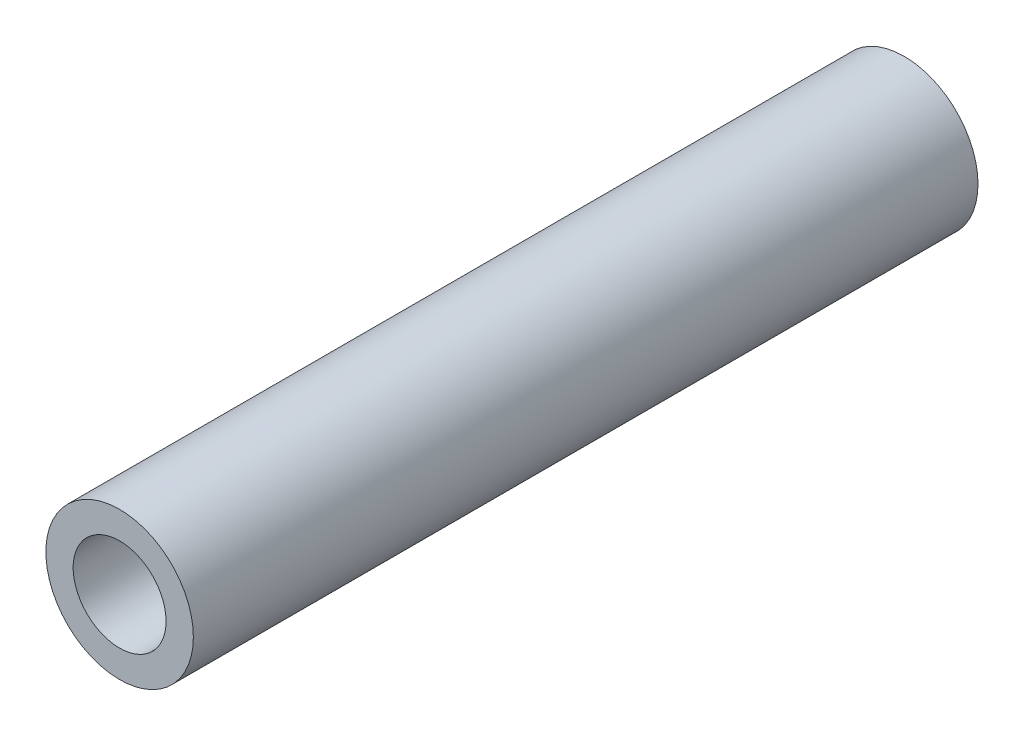
ISO-10303-21;
HEADER;
FILE_DESCRIPTION(('STEP AP214'),'2;1');
FILE_NAME('part.step','',(''),(''),'','','');
FILE_SCHEMA(('AUTOMOTIVE_DESIGN { 1 0 10303 214 1 1 1 1 }'));
ENDSEC;
DATA;
#1=APPLICATION_CONTEXT('core data for automotive mechanical design processes');
#2=APPLICATION_PROTOCOL_DEFINITION('international standard','automotive_design',2000,#1);
#3=PRODUCT_CONTEXT('',#1,'mechanical');
#4=PRODUCT('Part','Part','',(#3));
#5=PRODUCT_RELATED_PRODUCT_CATEGORY('part','',(#4));
#6=PRODUCT_DEFINITION_FORMATION('','',#4);
#7=PRODUCT_DEFINITION_CONTEXT('part definition',#1,'design');
#8=PRODUCT_DEFINITION('design','',#6,#7);
#9=PRODUCT_DEFINITION_SHAPE('','',#8);
#10=(LENGTH_UNIT() NAMED_UNIT(*) SI_UNIT(.MILLI.,.METRE.));
#11=(NAMED_UNIT(*) PLANE_ANGLE_UNIT() SI_UNIT($,.RADIAN.));
#12=(NAMED_UNIT(*) SI_UNIT($,.STERADIAN.) SOLID_ANGLE_UNIT());
#13=UNCERTAINTY_MEASURE_WITH_UNIT(LENGTH_MEASURE(1.E-05),#10,'distance_accuracy_value','');
#14=(GEOMETRIC_REPRESENTATION_CONTEXT(3) GLOBAL_UNCERTAINTY_ASSIGNED_CONTEXT((#13)) GLOBAL_UNIT_ASSIGNED_CONTEXT((#10,
#11,#12)) REPRESENTATION_CONTEXT('',''));
#15=CARTESIAN_POINT('',(0.,0.,0.));
#16=DIRECTION('',(0.,0.,1.));
#17=DIRECTION('',(1.,0.,0.));
#18=AXIS2_PLACEMENT_3D('',#15,#16,#17);
#19=CARTESIAN_POINT('',(0.,0.,-41.8717561210692));
#20=DIRECTION('',(0.,0.,1.));
#21=DIRECTION('',(1.,0.,0.));
#22=AXIS2_PLACEMENT_3D('',#19,#20,#21);
#23=CYLINDRICAL_SURFACE('',#22,2.286);
#24=CARTESIAN_POINT('',(0.,0.,-33.7805));
#25=DIRECTION('',(0.,0.,-1.));
#26=DIRECTION('',(-1.,0.,0.));
#27=AXIS2_PLACEMENT_3D('',#24,#25,#26);
#28=CIRCLE('',#27,2.286);
#29=CARTESIAN_POINT('',(-2.286,0.,-33.7805));
#30=VERTEX_POINT('',#29);
#31=EDGE_CURVE('E56',#30,#30,#28,.T.);
#32=ORIENTED_EDGE('',*,*,#31,.T.);
#33=EDGE_LOOP('',(#32));
#34=FACE_BOUND('',#33,.T.);
#35=CARTESIAN_POINT('',(0.,0.,-12.7));
#36=DIRECTION('',(0.,0.,1.));
#37=DIRECTION('',(1.,0.,0.));
#38=AXIS2_PLACEMENT_3D('',#35,#36,#37);
#39=CIRCLE('',#38,2.286);
#40=CARTESIAN_POINT('',(2.286,0.,-12.7));
#41=VERTEX_POINT('',#40);
#42=EDGE_CURVE('E11',#41,#41,#39,.F.);
#43=ORIENTED_EDGE('',*,*,#42,.F.);
#44=EDGE_LOOP('',(#43));
#45=FACE_BOUND('',#44,.T.);
#46=ADVANCED_FACE('F42',(#34,#45),#23,.F.);
#47=CARTESIAN_POINT('',(0.,0.,-41.8717561210692));
#48=DIRECTION('',(0.,0.,1.));
#49=DIRECTION('',(1.,0.,0.));
#50=AXIS2_PLACEMENT_3D('',#47,#48,#49);
#51=CYLINDRICAL_SURFACE('',#50,3.175);
#52=CARTESIAN_POINT('',(0.,0.,0.));
#53=DIRECTION('',(0.,0.,1.));
#54=DIRECTION('',(1.,0.,0.));
#55=AXIS2_PLACEMENT_3D('',#52,#53,#54);
#56=CIRCLE('',#55,3.175);
#57=CARTESIAN_POINT('',(3.175,0.,0.));
#58=VERTEX_POINT('',#57);
#59=EDGE_CURVE('E48',#58,#58,#56,.T.);
#60=ORIENTED_EDGE('',*,*,#59,.F.);
#61=EDGE_LOOP('',(#60));
#62=FACE_BOUND('',#61,.T.);
#63=CARTESIAN_POINT('',(0.,0.,-33.7805));
#64=DIRECTION('',(0.,0.,-1.));
#65=DIRECTION('',(-1.,0.,0.));
#66=AXIS2_PLACEMENT_3D('',#63,#64,#65);
#67=CIRCLE('',#66,3.175);
#68=CARTESIAN_POINT('',(-3.175,0.,-33.7805));
#69=VERTEX_POINT('',#68);
#70=EDGE_CURVE('E52',#69,#69,#67,.T.);
#71=ORIENTED_EDGE('',*,*,#70,.F.);
#72=EDGE_LOOP('',(#71));
#73=FACE_BOUND('',#72,.T.);
#74=ADVANCED_FACE('F73',(#62,#73),#51,.T.);
#75=CARTESIAN_POINT('',(0.,0.,0.));
#76=DIRECTION('',(0.,0.,1.));
#77=DIRECTION('',(1.,0.,0.));
#78=AXIS2_PLACEMENT_3D('',#75,#76,#77);
#79=PLANE('',#78);
#80=ORIENTED_EDGE('',*,*,#59,.T.);
#81=EDGE_LOOP('',(#80));
#82=FACE_BOUND('',#81,.T.);
#83=CARTESIAN_POINT('',(0.,0.,0.));
#84=DIRECTION('',(0.,0.,1.));
#85=DIRECTION('',(1.,0.,0.));
#86=AXIS2_PLACEMENT_3D('',#83,#84,#85);
#87=CIRCLE('',#86,2.);
#88=CARTESIAN_POINT('',(2.,0.,0.));
#89=VERTEX_POINT('',#88);
#90=EDGE_CURVE('E64',#89,#89,#87,.T.);
#91=ORIENTED_EDGE('',*,*,#90,.F.);
#92=EDGE_LOOP('',(#91));
#93=FACE_BOUND('',#92,.T.);
#94=ADVANCED_FACE('F70',(#82,#93),#79,.T.);
#95=CARTESIAN_POINT('',(0.,0.,-33.7805));
#96=DIRECTION('',(0.,0.,-1.));
#97=DIRECTION('',(-1.,0.,0.));
#98=AXIS2_PLACEMENT_3D('',#95,#96,#97);
#99=PLANE('',#98);
#100=ORIENTED_EDGE('',*,*,#70,.T.);
#101=EDGE_LOOP('',(#100));
#102=FACE_BOUND('',#101,.T.);
#103=ORIENTED_EDGE('',*,*,#31,.F.);
#104=EDGE_LOOP('',(#103));
#105=FACE_BOUND('',#104,.T.);
#106=ADVANCED_FACE('F72',(#102,#105),#99,.T.);
#107=CARTESIAN_POINT('',(0.,0.,-12.7));
#108=DIRECTION('',(0.,0.,1.));
#109=DIRECTION('',(1.,0.,0.));
#110=AXIS2_PLACEMENT_3D('',#107,#108,#109);
#111=PLANE('',#110);
#112=CARTESIAN_POINT('',(0.,0.,-12.7));
#113=DIRECTION('',(0.,0.,1.));
#114=DIRECTION('',(1.,0.,0.));
#115=AXIS2_PLACEMENT_3D('',#112,#113,#114);
#116=CIRCLE('',#115,1.77832067541164);
#117=CARTESIAN_POINT('',(1.77832067541164,0.,-12.7));
#118=VERTEX_POINT('',#117);
#119=EDGE_CURVE('E61',#118,#118,#116,.T.);
#120=ORIENTED_EDGE('',*,*,#119,.T.);
#121=EDGE_LOOP('',(#120));
#122=FACE_BOUND('',#121,.T.);
#123=ORIENTED_EDGE('',*,*,#42,.T.);
#124=EDGE_LOOP('',(#123));
#125=FACE_BOUND('',#124,.T.);
#126=ADVANCED_FACE('F79',(#122,#125),#111,.F.);
#127=CARTESIAN_POINT('',(0.,0.,0.));
#128=DIRECTION('',(0.,0.,1.));
#129=DIRECTION('',(1.,0.,0.));
#130=AXIS2_PLACEMENT_3D('',#127,#128,#129);
#131=CONICAL_SURFACE('',#130,2.,0.0174532925199433);
#132=ORIENTED_EDGE('',*,*,#119,.F.);
#133=EDGE_LOOP('',(#132));
#134=FACE_BOUND('',#133,.T.);
#135=ORIENTED_EDGE('',*,*,#90,.T.);
#136=EDGE_LOOP('',(#135));
#137=FACE_BOUND('',#136,.T.);
#138=ADVANCED_FACE('F68',(#134,#137),#131,.F.);
#139=CLOSED_SHELL('',(#46,#74,#94,#106,#126,#138));
#140=MANIFOLD_SOLID_BREP('B2',#139);
#141=ADVANCED_BREP_SHAPE_REPRESENTATION('',(#18,#140),#14);
#142=SHAPE_DEFINITION_REPRESENTATION(#9,#141);
ENDSEC;
END-ISO-10303-21;
